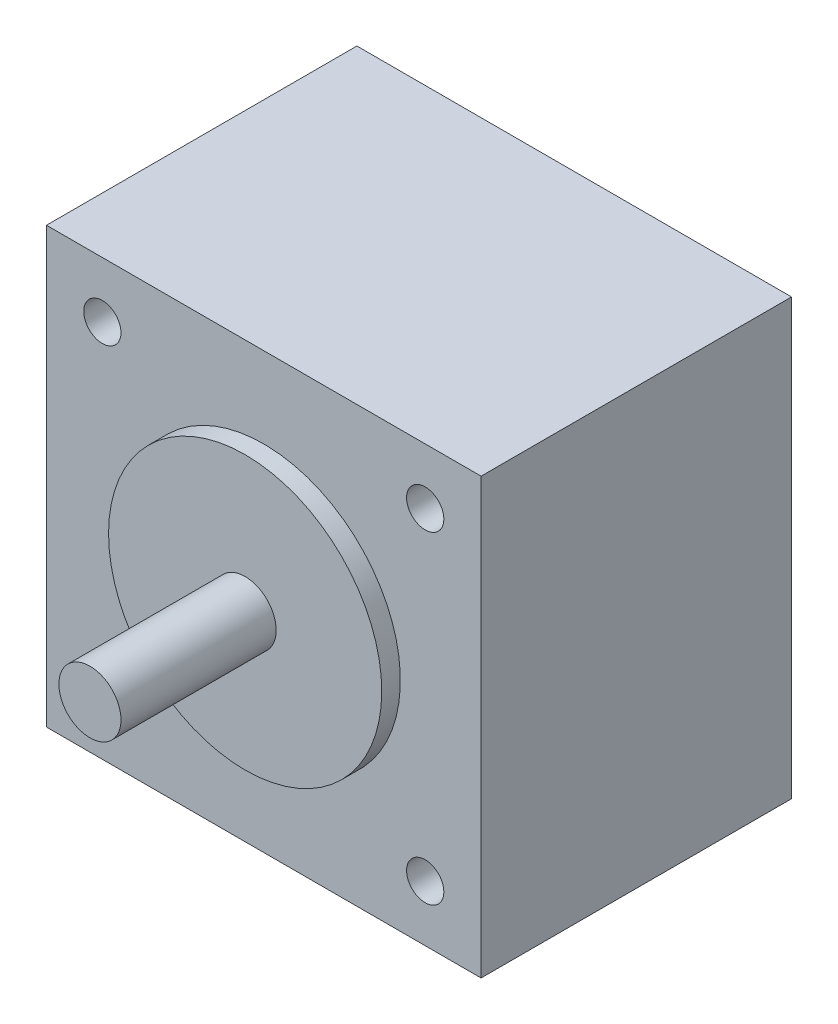
ISO-10303-21;
HEADER;
FILE_DESCRIPTION(('STEP AP214'),'2;1');
FILE_NAME('part.step','',(''),(''),'','','');
FILE_SCHEMA(('AUTOMOTIVE_DESIGN { 1 0 10303 214 1 1 1 1 }'));
ENDSEC;
DATA;
#1=APPLICATION_CONTEXT('core data for automotive mechanical design processes');
#2=APPLICATION_PROTOCOL_DEFINITION('international standard','automotive_design',2000,#1);
#3=PRODUCT_CONTEXT('',#1,'mechanical');
#4=PRODUCT('Part','Part','',(#3));
#5=PRODUCT_RELATED_PRODUCT_CATEGORY('part','',(#4));
#6=PRODUCT_DEFINITION_FORMATION('','',#4);
#7=PRODUCT_DEFINITION_CONTEXT('part definition',#1,'design');
#8=PRODUCT_DEFINITION('design','',#6,#7);
#9=PRODUCT_DEFINITION_SHAPE('','',#8);
#10=(LENGTH_UNIT() NAMED_UNIT(*) SI_UNIT(.MILLI.,.METRE.));
#11=(NAMED_UNIT(*) PLANE_ANGLE_UNIT() SI_UNIT($,.RADIAN.));
#12=(NAMED_UNIT(*) SI_UNIT($,.STERADIAN.) SOLID_ANGLE_UNIT());
#13=UNCERTAINTY_MEASURE_WITH_UNIT(LENGTH_MEASURE(1.E-05),#10,'distance_accuracy_value','');
#14=(GEOMETRIC_REPRESENTATION_CONTEXT(3) GLOBAL_UNCERTAINTY_ASSIGNED_CONTEXT((#13)) GLOBAL_UNIT_ASSIGNED_CONTEXT((#10,
#11,#12)) REPRESENTATION_CONTEXT('',''));
#15=CARTESIAN_POINT('',(0.,0.,0.));
#16=DIRECTION('',(0.,0.,1.));
#17=DIRECTION('',(1.,0.,0.));
#18=AXIS2_PLACEMENT_3D('',#15,#16,#17);
#19=CARTESIAN_POINT('',(17.5,17.5,0.));
#20=DIRECTION('',(0.,0.,-1.));
#21=DIRECTION('',(-1.,0.,0.));
#22=AXIS2_PLACEMENT_3D('',#19,#20,#21);
#23=PLANE('',#22);
#24=CARTESIAN_POINT('',(13.,-13.,0.));
#25=DIRECTION('',(0.,0.,1.));
#26=DIRECTION('',(1.,0.,0.));
#27=AXIS2_PLACEMENT_3D('',#24,#25,#26);
#28=CIRCLE('',#27,1.5);
#29=CARTESIAN_POINT('',(14.5,-13.,0.));
#30=VERTEX_POINT('',#29);
#31=EDGE_CURVE('E141',#30,#30,#28,.T.);
#32=ORIENTED_EDGE('',*,*,#31,.T.);
#33=EDGE_LOOP('',(#32));
#34=FACE_BOUND('',#33,.T.);
#35=CARTESIAN_POINT('',(13.,13.,0.));
#36=DIRECTION('',(0.,0.,1.));
#37=DIRECTION('',(1.,0.,0.));
#38=AXIS2_PLACEMENT_3D('',#35,#36,#37);
#39=CIRCLE('',#38,1.5);
#40=CARTESIAN_POINT('',(14.5,13.,0.));
#41=VERTEX_POINT('',#40);
#42=EDGE_CURVE('E150',#41,#41,#39,.T.);
#43=ORIENTED_EDGE('',*,*,#42,.T.);
#44=EDGE_LOOP('',(#43));
#45=FACE_BOUND('',#44,.T.);
#46=DIRECTION('',(0.,1.,0.));
#47=VECTOR('',#46,1.);
#48=CARTESIAN_POINT('',(17.5,-17.5,0.));
#49=LINE('',#48,#47);
#50=CARTESIAN_POINT('',(17.5,-17.5,0.));
#51=VERTEX_POINT('',#50);
#52=CARTESIAN_POINT('',(17.5,17.5,0.));
#53=VERTEX_POINT('',#52);
#54=EDGE_CURVE('E99',#51,#53,#49,.T.);
#55=ORIENTED_EDGE('',*,*,#54,.F.);
#56=DIRECTION('',(1.,0.,0.));
#57=VECTOR('',#56,1.);
#58=CARTESIAN_POINT('',(-17.5,-17.5,0.));
#59=LINE('',#58,#57);
#60=CARTESIAN_POINT('',(-17.5,-17.5,0.));
#61=VERTEX_POINT('',#60);
#62=EDGE_CURVE('E71',#61,#51,#59,.T.);
#63=ORIENTED_EDGE('',*,*,#62,.F.);
#64=DIRECTION('',(0.,-1.,0.));
#65=VECTOR('',#64,1.);
#66=CARTESIAN_POINT('',(-17.5,-17.5,0.));
#67=LINE('',#66,#65);
#68=CARTESIAN_POINT('',(-17.5,17.5,0.));
#69=VERTEX_POINT('',#68);
#70=EDGE_CURVE('E65',#69,#61,#67,.T.);
#71=ORIENTED_EDGE('',*,*,#70,.F.);
#72=DIRECTION('',(-1.,0.,0.));
#73=VECTOR('',#72,1.);
#74=CARTESIAN_POINT('',(-17.5,17.5,0.));
#75=LINE('',#74,#73);
#76=EDGE_CURVE('E90',#53,#69,#75,.T.);
#77=ORIENTED_EDGE('',*,*,#76,.F.);
#78=EDGE_LOOP('',(#55,#63,#71,#77));
#79=FACE_BOUND('',#78,.T.);
#80=CARTESIAN_POINT('',(-13.,13.,0.));
#81=DIRECTION('',(0.,0.,1.));
#82=DIRECTION('',(1.,0.,0.));
#83=AXIS2_PLACEMENT_3D('',#80,#81,#82);
#84=CIRCLE('',#83,1.5);
#85=CARTESIAN_POINT('',(-11.5,13.,0.));
#86=VERTEX_POINT('',#85);
#87=EDGE_CURVE('E118',#86,#86,#84,.T.);
#88=ORIENTED_EDGE('',*,*,#87,.T.);
#89=EDGE_LOOP('',(#88));
#90=FACE_BOUND('',#89,.T.);
#91=CARTESIAN_POINT('',(-13.,-13.,0.));
#92=DIRECTION('',(0.,0.,1.));
#93=DIRECTION('',(1.,0.,0.));
#94=AXIS2_PLACEMENT_3D('',#91,#92,#93);
#95=CIRCLE('',#94,1.5);
#96=CARTESIAN_POINT('',(-11.5,-13.,0.));
#97=VERTEX_POINT('',#96);
#98=EDGE_CURVE('E122',#97,#97,#95,.T.);
#99=ORIENTED_EDGE('',*,*,#98,.T.);
#100=EDGE_LOOP('',(#99));
#101=FACE_BOUND('',#100,.T.);
#102=CARTESIAN_POINT('',(0.,0.,0.));
#103=DIRECTION('',(0.,0.,-1.));
#104=DIRECTION('',(-1.,0.,0.));
#105=AXIS2_PLACEMENT_3D('',#102,#103,#104);
#106=CIRCLE('',#105,2.5);
#107=CARTESIAN_POINT('',(-2.5,0.,0.));
#108=VERTEX_POINT('',#107);
#109=EDGE_CURVE('E125',#108,#108,#106,.T.);
#110=ORIENTED_EDGE('',*,*,#109,.F.);
#111=EDGE_LOOP('',(#110));
#112=FACE_BOUND('',#111,.T.);
#113=ADVANCED_FACE('F31',(#34,#45,#79,#90,#101,#112),#23,.T.);
#114=CARTESIAN_POINT('',(0.,0.,26.5));
#115=DIRECTION('',(0.,0.,1.));
#116=DIRECTION('',(1.,0.,0.));
#117=AXIS2_PLACEMENT_3D('',#114,#115,#116);
#118=PLANE('',#117);
#119=CARTESIAN_POINT('',(0.,0.,26.5));
#120=DIRECTION('',(0.,0.,1.));
#121=DIRECTION('',(1.,0.,0.));
#122=AXIS2_PLACEMENT_3D('',#119,#120,#121);
#123=CIRCLE('',#122,11.);
#124=CARTESIAN_POINT('',(11.,0.,26.5));
#125=VERTEX_POINT('',#124);
#126=EDGE_CURVE('E136',#125,#125,#123,.T.);
#127=ORIENTED_EDGE('',*,*,#126,.T.);
#128=EDGE_LOOP('',(#127));
#129=FACE_BOUND('',#128,.T.);
#130=CARTESIAN_POINT('',(0.,0.,26.5));
#131=DIRECTION('',(0.,0.,1.));
#132=DIRECTION('',(1.,0.,0.));
#133=AXIS2_PLACEMENT_3D('',#130,#131,#132);
#134=CIRCLE('',#133,2.5);
#135=CARTESIAN_POINT('',(2.5,0.,26.5));
#136=VERTEX_POINT('',#135);
#137=EDGE_CURVE('E130',#136,#136,#134,.T.);
#138=ORIENTED_EDGE('',*,*,#137,.F.);
#139=EDGE_LOOP('',(#138));
#140=FACE_BOUND('',#139,.T.);
#141=ADVANCED_FACE('F112',(#129,#140),#118,.T.);
#142=CARTESIAN_POINT('',(17.5,17.5,25.));
#143=DIRECTION('',(0.,0.,-1.));
#144=DIRECTION('',(-1.,0.,0.));
#145=AXIS2_PLACEMENT_3D('',#142,#143,#144);
#146=PLANE('',#145);
#147=CARTESIAN_POINT('',(13.,-13.,25.));
#148=DIRECTION('',(0.,0.,1.));
#149=DIRECTION('',(1.,0.,0.));
#150=AXIS2_PLACEMENT_3D('',#147,#148,#149);
#151=CIRCLE('',#150,1.5);
#152=CARTESIAN_POINT('',(14.5,-13.,25.));
#153=VERTEX_POINT('',#152);
#154=EDGE_CURVE('E142',#153,#153,#151,.T.);
#155=ORIENTED_EDGE('',*,*,#154,.F.);
#156=EDGE_LOOP('',(#155));
#157=FACE_BOUND('',#156,.T.);
#158=CARTESIAN_POINT('',(13.,13.,25.));
#159=DIRECTION('',(0.,0.,1.));
#160=DIRECTION('',(1.,0.,0.));
#161=AXIS2_PLACEMENT_3D('',#158,#159,#160);
#162=CIRCLE('',#161,1.5);
#163=CARTESIAN_POINT('',(14.5,13.,25.));
#164=VERTEX_POINT('',#163);
#165=EDGE_CURVE('E152',#164,#164,#162,.T.);
#166=ORIENTED_EDGE('',*,*,#165,.F.);
#167=EDGE_LOOP('',(#166));
#168=FACE_BOUND('',#167,.T.);
#169=DIRECTION('',(0.,1.,0.));
#170=VECTOR('',#169,1.);
#171=CARTESIAN_POINT('',(17.5,-17.5,25.));
#172=LINE('',#171,#170);
#173=CARTESIAN_POINT('',(17.5,-17.5,25.));
#174=VERTEX_POINT('',#173);
#175=CARTESIAN_POINT('',(17.5,17.5,25.));
#176=VERTEX_POINT('',#175);
#177=EDGE_CURVE('E85',#174,#176,#172,.T.);
#178=ORIENTED_EDGE('',*,*,#177,.T.);
#179=DIRECTION('',(-1.,0.,0.));
#180=VECTOR('',#179,1.);
#181=CARTESIAN_POINT('',(-17.5,17.5,25.));
#182=LINE('',#181,#180);
#183=CARTESIAN_POINT('',(-17.5,17.5,25.));
#184=VERTEX_POINT('',#183);
#185=EDGE_CURVE('E79',#176,#184,#182,.T.);
#186=ORIENTED_EDGE('',*,*,#185,.T.);
#187=DIRECTION('',(0.,-1.,0.));
#188=VECTOR('',#187,1.);
#189=CARTESIAN_POINT('',(-17.5,-17.5,25.));
#190=LINE('',#189,#188);
#191=CARTESIAN_POINT('',(-17.5,-17.5,25.));
#192=VERTEX_POINT('',#191);
#193=EDGE_CURVE('E83',#184,#192,#190,.T.);
#194=ORIENTED_EDGE('',*,*,#193,.T.);
#195=DIRECTION('',(1.,0.,0.));
#196=VECTOR('',#195,1.);
#197=CARTESIAN_POINT('',(-17.5,-17.5,25.));
#198=LINE('',#197,#196);
#199=EDGE_CURVE('E48',#192,#174,#198,.T.);
#200=ORIENTED_EDGE('',*,*,#199,.T.);
#201=EDGE_LOOP('',(#178,#186,#194,#200));
#202=FACE_BOUND('',#201,.T.);
#203=CARTESIAN_POINT('',(-13.,13.,25.));
#204=DIRECTION('',(0.,0.,1.));
#205=DIRECTION('',(1.,0.,0.));
#206=AXIS2_PLACEMENT_3D('',#203,#204,#205);
#207=CIRCLE('',#206,1.5);
#208=CARTESIAN_POINT('',(-11.5,13.,25.));
#209=VERTEX_POINT('',#208);
#210=EDGE_CURVE('E102',#209,#209,#207,.T.);
#211=ORIENTED_EDGE('',*,*,#210,.F.);
#212=EDGE_LOOP('',(#211));
#213=FACE_BOUND('',#212,.T.);
#214=CARTESIAN_POINT('',(-13.,-13.,25.));
#215=DIRECTION('',(0.,0.,1.));
#216=DIRECTION('',(1.,0.,0.));
#217=AXIS2_PLACEMENT_3D('',#214,#215,#216);
#218=CIRCLE('',#217,1.5);
#219=CARTESIAN_POINT('',(-11.5,-13.,25.));
#220=VERTEX_POINT('',#219);
#221=EDGE_CURVE('E147',#220,#220,#218,.T.);
#222=ORIENTED_EDGE('',*,*,#221,.F.);
#223=EDGE_LOOP('',(#222));
#224=FACE_BOUND('',#223,.T.);
#225=CARTESIAN_POINT('',(0.,0.,25.));
#226=DIRECTION('',(0.,0.,-1.));
#227=DIRECTION('',(-1.,0.,0.));
#228=AXIS2_PLACEMENT_3D('',#225,#226,#227);
#229=CIRCLE('',#228,11.);
#230=CARTESIAN_POINT('',(-11.,0.,25.));
#231=VERTEX_POINT('',#230);
#232=EDGE_CURVE('E11',#231,#231,#229,.F.);
#233=ORIENTED_EDGE('',*,*,#232,.F.);
#234=EDGE_LOOP('',(#233));
#235=FACE_BOUND('',#234,.T.);
#236=ADVANCED_FACE('F80',(#157,#168,#202,#213,#224,#235),#146,.F.);
#237=CARTESIAN_POINT('',(17.5,-17.5,25.));
#238=DIRECTION('',(-1.,0.,0.));
#239=DIRECTION('',(0.,0.,1.));
#240=AXIS2_PLACEMENT_3D('',#237,#238,#239);
#241=PLANE('',#240);
#242=ORIENTED_EDGE('',*,*,#54,.T.);
#243=DIRECTION('',(0.,0.,-1.));
#244=VECTOR('',#243,1.);
#245=CARTESIAN_POINT('',(17.5,17.5,25.));
#246=LINE('',#245,#244);
#247=EDGE_CURVE('E40',#176,#53,#246,.T.);
#248=ORIENTED_EDGE('',*,*,#247,.F.);
#249=ORIENTED_EDGE('',*,*,#177,.F.);
#250=DIRECTION('',(0.,0.,-1.));
#251=VECTOR('',#250,1.);
#252=CARTESIAN_POINT('',(17.5,-17.5,25.));
#253=LINE('',#252,#251);
#254=EDGE_CURVE('E95',#174,#51,#253,.T.);
#255=ORIENTED_EDGE('',*,*,#254,.T.);
#256=EDGE_LOOP('',(#242,#248,#249,#255));
#257=FACE_BOUND('',#256,.T.);
#258=ADVANCED_FACE('F33',(#257),#241,.F.);
#259=CARTESIAN_POINT('',(-17.5,17.5,25.));
#260=DIRECTION('',(0.,-1.,0.));
#261=DIRECTION('',(0.,0.,-1.));
#262=AXIS2_PLACEMENT_3D('',#259,#260,#261);
#263=PLANE('',#262);
#264=ORIENTED_EDGE('',*,*,#76,.T.);
#265=DIRECTION('',(0.,0.,-1.));
#266=VECTOR('',#265,1.);
#267=CARTESIAN_POINT('',(-17.5,17.5,25.));
#268=LINE('',#267,#266);
#269=EDGE_CURVE('E88',#184,#69,#268,.T.);
#270=ORIENTED_EDGE('',*,*,#269,.F.);
#271=ORIENTED_EDGE('',*,*,#185,.F.);
#272=ORIENTED_EDGE('',*,*,#247,.T.);
#273=EDGE_LOOP('',(#264,#270,#271,#272));
#274=FACE_BOUND('',#273,.T.);
#275=ADVANCED_FACE('F89',(#274),#263,.F.);
#276=CARTESIAN_POINT('',(-17.5,-17.5,25.));
#277=DIRECTION('',(1.,0.,0.));
#278=DIRECTION('',(0.,0.,-1.));
#279=AXIS2_PLACEMENT_3D('',#276,#277,#278);
#280=PLANE('',#279);
#281=ORIENTED_EDGE('',*,*,#70,.T.);
#282=DIRECTION('',(0.,0.,-1.));
#283=VECTOR('',#282,1.);
#284=CARTESIAN_POINT('',(-17.5,-17.5,25.));
#285=LINE('',#284,#283);
#286=EDGE_CURVE('E91',#192,#61,#285,.T.);
#287=ORIENTED_EDGE('',*,*,#286,.F.);
#288=ORIENTED_EDGE('',*,*,#193,.F.);
#289=ORIENTED_EDGE('',*,*,#269,.T.);
#290=EDGE_LOOP('',(#281,#287,#288,#289));
#291=FACE_BOUND('',#290,.T.);
#292=ADVANCED_FACE('F93',(#291),#280,.F.);
#293=CARTESIAN_POINT('',(-17.5,-17.5,25.));
#294=DIRECTION('',(0.,1.,0.));
#295=DIRECTION('',(0.,0.,1.));
#296=AXIS2_PLACEMENT_3D('',#293,#294,#295);
#297=PLANE('',#296);
#298=ORIENTED_EDGE('',*,*,#62,.T.);
#299=ORIENTED_EDGE('',*,*,#254,.F.);
#300=ORIENTED_EDGE('',*,*,#199,.F.);
#301=ORIENTED_EDGE('',*,*,#286,.T.);
#302=EDGE_LOOP('',(#298,#299,#300,#301));
#303=FACE_BOUND('',#302,.T.);
#304=ADVANCED_FACE('F198',(#303),#297,.F.);
#305=CARTESIAN_POINT('',(-13.,13.,25.));
#306=DIRECTION('',(0.,0.,-1.));
#307=DIRECTION('',(-1.,0.,0.));
#308=AXIS2_PLACEMENT_3D('',#305,#306,#307);
#309=CYLINDRICAL_SURFACE('',#308,1.5);
#310=ORIENTED_EDGE('',*,*,#210,.T.);
#311=EDGE_LOOP('',(#310));
#312=FACE_BOUND('',#311,.T.);
#313=ORIENTED_EDGE('',*,*,#87,.F.);
#314=EDGE_LOOP('',(#313));
#315=FACE_BOUND('',#314,.T.);
#316=ADVANCED_FACE('F161',(#312,#315),#309,.F.);
#317=CARTESIAN_POINT('',(13.,13.,25.));
#318=DIRECTION('',(0.,0.,-1.));
#319=DIRECTION('',(-1.,0.,0.));
#320=AXIS2_PLACEMENT_3D('',#317,#318,#319);
#321=CYLINDRICAL_SURFACE('',#320,1.5);
#322=ORIENTED_EDGE('',*,*,#165,.T.);
#323=EDGE_LOOP('',(#322));
#324=FACE_BOUND('',#323,.T.);
#325=ORIENTED_EDGE('',*,*,#42,.F.);
#326=EDGE_LOOP('',(#325));
#327=FACE_BOUND('',#326,.T.);
#328=ADVANCED_FACE('F192',(#324,#327),#321,.F.);
#329=CARTESIAN_POINT('',(-13.,-13.,25.));
#330=DIRECTION('',(0.,0.,-1.));
#331=DIRECTION('',(-1.,0.,0.));
#332=AXIS2_PLACEMENT_3D('',#329,#330,#331);
#333=CYLINDRICAL_SURFACE('',#332,1.5);
#334=ORIENTED_EDGE('',*,*,#221,.T.);
#335=EDGE_LOOP('',(#334));
#336=FACE_BOUND('',#335,.T.);
#337=ORIENTED_EDGE('',*,*,#98,.F.);
#338=EDGE_LOOP('',(#337));
#339=FACE_BOUND('',#338,.T.);
#340=ADVANCED_FACE('F184',(#336,#339),#333,.F.);
#341=CARTESIAN_POINT('',(13.,-13.,25.));
#342=DIRECTION('',(0.,0.,-1.));
#343=DIRECTION('',(-1.,0.,0.));
#344=AXIS2_PLACEMENT_3D('',#341,#342,#343);
#345=CYLINDRICAL_SURFACE('',#344,1.5);
#346=ORIENTED_EDGE('',*,*,#154,.T.);
#347=EDGE_LOOP('',(#346));
#348=FACE_BOUND('',#347,.T.);
#349=ORIENTED_EDGE('',*,*,#31,.F.);
#350=EDGE_LOOP('',(#349));
#351=FACE_BOUND('',#350,.T.);
#352=ADVANCED_FACE('F174',(#348,#351),#345,.F.);
#353=CARTESIAN_POINT('',(0.,0.,26.5));
#354=DIRECTION('',(0.,0.,-1.));
#355=DIRECTION('',(-1.,0.,0.));
#356=AXIS2_PLACEMENT_3D('',#353,#354,#355);
#357=CYLINDRICAL_SURFACE('',#356,11.);
#358=ORIENTED_EDGE('',*,*,#126,.F.);
#359=EDGE_LOOP('',(#358));
#360=FACE_BOUND('',#359,.T.);
#361=ORIENTED_EDGE('',*,*,#232,.T.);
#362=EDGE_LOOP('',(#361));
#363=FACE_BOUND('',#362,.T.);
#364=ADVANCED_FACE('F171',(#360,#363),#357,.T.);
#365=CARTESIAN_POINT('',(0.,0.,39.));
#366=DIRECTION('',(0.,0.,-1.));
#367=DIRECTION('',(-1.,0.,0.));
#368=AXIS2_PLACEMENT_3D('',#365,#366,#367);
#369=CYLINDRICAL_SURFACE('',#368,2.5);
#370=CARTESIAN_POINT('',(0.,0.,39.));
#371=DIRECTION('',(0.,0.,1.));
#372=DIRECTION('',(1.,0.,0.));
#373=AXIS2_PLACEMENT_3D('',#370,#371,#372);
#374=CIRCLE('',#373,2.5);
#375=CARTESIAN_POINT('',(2.5,0.,39.));
#376=VERTEX_POINT('',#375);
#377=EDGE_CURVE('E133',#376,#376,#374,.T.);
#378=ORIENTED_EDGE('',*,*,#377,.F.);
#379=EDGE_LOOP('',(#378));
#380=FACE_BOUND('',#379,.T.);
#381=ORIENTED_EDGE('',*,*,#137,.T.);
#382=EDGE_LOOP('',(#381));
#383=FACE_BOUND('',#382,.T.);
#384=ADVANCED_FACE('F173',(#380,#383),#369,.T.);
#385=CARTESIAN_POINT('',(0.,0.,39.));
#386=DIRECTION('',(0.,0.,1.));
#387=DIRECTION('',(1.,0.,0.));
#388=AXIS2_PLACEMENT_3D('',#385,#386,#387);
#389=PLANE('',#388);
#390=ORIENTED_EDGE('',*,*,#377,.T.);
#391=EDGE_LOOP('',(#390));
#392=FACE_BOUND('',#391,.T.);
#393=ADVANCED_FACE('F181',(#392),#389,.T.);
#394=CARTESIAN_POINT('',(0.,0.,-10.));
#395=DIRECTION('',(0.,0.,1.));
#396=DIRECTION('',(1.,0.,0.));
#397=AXIS2_PLACEMENT_3D('',#394,#395,#396);
#398=CYLINDRICAL_SURFACE('',#397,2.5);
#399=CARTESIAN_POINT('',(0.,0.,-10.));
#400=DIRECTION('',(0.,0.,-1.));
#401=DIRECTION('',(-1.,0.,0.));
#402=AXIS2_PLACEMENT_3D('',#399,#400,#401);
#403=CIRCLE('',#402,2.5);
#404=CARTESIAN_POINT('',(-2.5,0.,-10.));
#405=VERTEX_POINT('',#404);
#406=EDGE_CURVE('E127',#405,#405,#403,.T.);
#407=ORIENTED_EDGE('',*,*,#406,.F.);
#408=EDGE_LOOP('',(#407));
#409=FACE_BOUND('',#408,.T.);
#410=ORIENTED_EDGE('',*,*,#109,.T.);
#411=EDGE_LOOP('',(#410));
#412=FACE_BOUND('',#411,.T.);
#413=ADVANCED_FACE('F235',(#409,#412),#398,.T.);
#414=CARTESIAN_POINT('',(0.,0.,-10.));
#415=DIRECTION('',(0.,0.,-1.));
#416=DIRECTION('',(-1.,0.,0.));
#417=AXIS2_PLACEMENT_3D('',#414,#415,#416);
#418=PLANE('',#417);
#419=ORIENTED_EDGE('',*,*,#406,.T.);
#420=EDGE_LOOP('',(#419));
#421=FACE_BOUND('',#420,.T.);
#422=ADVANCED_FACE('F239',(#421),#418,.T.);
#423=CLOSED_SHELL('',(#113,#141,#236,#258,#275,#292,#304,#316,#328,#340,#352,#364,#384,#393,
#413,#422));
#424=MANIFOLD_SOLID_BREP('B2',#423);
#425=ADVANCED_BREP_SHAPE_REPRESENTATION('',(#18,#424),#14);
#426=SHAPE_DEFINITION_REPRESENTATION(#9,#425);
ENDSEC;
END-ISO-10303-21;
